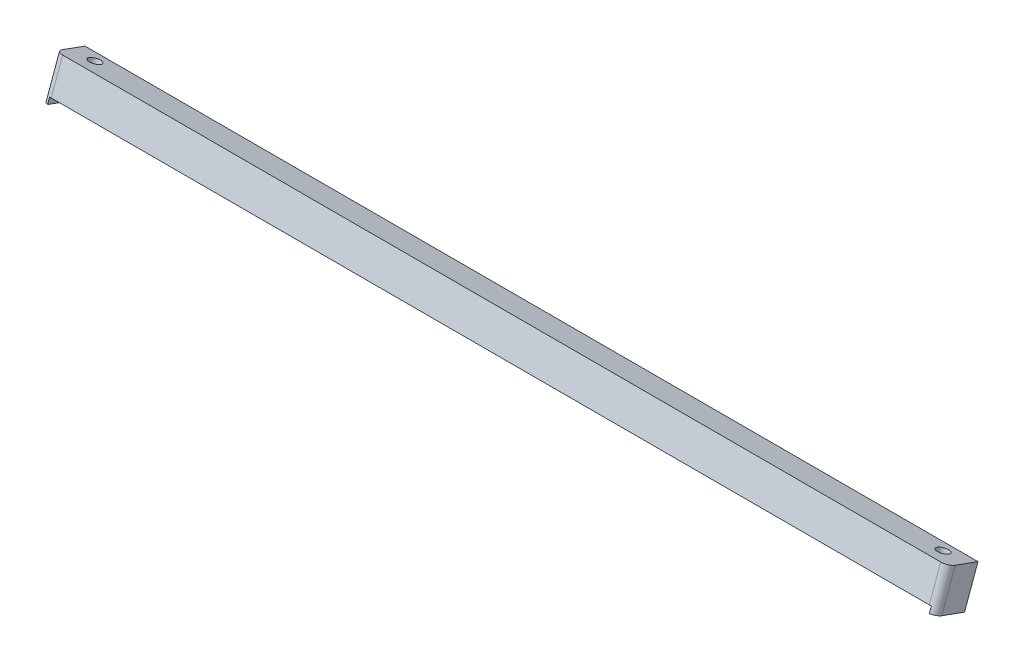
ISO-10303-21;
HEADER;
FILE_DESCRIPTION(('STEP AP214'),'2;1');
FILE_NAME('part.step','',(''),(''),'','','');
FILE_SCHEMA(('AUTOMOTIVE_DESIGN { 1 0 10303 214 1 1 1 1 }'));
ENDSEC;
DATA;
#1=APPLICATION_CONTEXT('core data for automotive mechanical design processes');
#2=APPLICATION_PROTOCOL_DEFINITION('international standard','automotive_design',2000,#1);
#3=PRODUCT_CONTEXT('',#1,'mechanical');
#4=PRODUCT('Part','Part','',(#3));
#5=PRODUCT_RELATED_PRODUCT_CATEGORY('part','',(#4));
#6=PRODUCT_DEFINITION_FORMATION('','',#4);
#7=PRODUCT_DEFINITION_CONTEXT('part definition',#1,'design');
#8=PRODUCT_DEFINITION('design','',#6,#7);
#9=PRODUCT_DEFINITION_SHAPE('','',#8);
#10=(LENGTH_UNIT() NAMED_UNIT(*) SI_UNIT(.MILLI.,.METRE.));
#11=(NAMED_UNIT(*) PLANE_ANGLE_UNIT() SI_UNIT($,.RADIAN.));
#12=(NAMED_UNIT(*) SI_UNIT($,.STERADIAN.) SOLID_ANGLE_UNIT());
#13=UNCERTAINTY_MEASURE_WITH_UNIT(LENGTH_MEASURE(1.E-05),#10,'distance_accuracy_value','');
#14=(GEOMETRIC_REPRESENTATION_CONTEXT(3) GLOBAL_UNCERTAINTY_ASSIGNED_CONTEXT((#13)) GLOBAL_UNIT_ASSIGNED_CONTEXT((#10,
#11,#12)) REPRESENTATION_CONTEXT('',''));
#15=CARTESIAN_POINT('',(0.,0.,0.));
#16=DIRECTION('',(0.,0.,1.));
#17=DIRECTION('',(1.,0.,0.));
#18=AXIS2_PLACEMENT_3D('',#15,#16,#17);
#19=CARTESIAN_POINT('',(239.,3.93699985869353,8.11895783615206));
#20=DIRECTION('',(0.,-0.342020143325677,-0.939692620785905));
#21=DIRECTION('',(0.,0.939692620785905,-0.342020143325677));
#22=AXIS2_PLACEMENT_3D('',#19,#20,#21);
#23=PLANE('',#22);
#24=DIRECTION('',(1.,0.,0.));
#25=VECTOR('',#24,1.);
#26=CARTESIAN_POINT('',(239.,12.3472488147274,5.05787755338725));
#27=LINE('',#26,#25);
#28=CARTESIAN_POINT('',(2.,12.3472488147274,5.05787755338725));
#29=VERTEX_POINT('',#28);
#30=CARTESIAN_POINT('',(237.,12.3472488147274,5.05787755338725));
#31=VERTEX_POINT('',#30);
#32=EDGE_CURVE('E110',#29,#31,#27,.T.);
#33=ORIENTED_EDGE('',*,*,#32,.F.);
#34=DIRECTION('',(0.,-0.939692620785905,0.342020143325677));
#35=VECTOR('',#34,1.);
#36=CARTESIAN_POINT('',(2.,3.93699985869353,8.11895783615206));
#37=LINE('',#36,#35);
#38=CARTESIAN_POINT('',(2.00000000000006,3.93699985869353,8.11895783615206));
#39=VERTEX_POINT('',#38);
#40=EDGE_CURVE('E119',#29,#39,#37,.T.);
#41=ORIENTED_EDGE('',*,*,#40,.T.);
#42=DIRECTION('',(-1.,0.,0.));
#43=VECTOR('',#42,1.);
#44=CARTESIAN_POINT('',(239.,3.93699985869353,8.11895783615206));
#45=LINE('',#44,#43);
#46=CARTESIAN_POINT('',(237.,3.93699985869353,8.11895783615206));
#47=VERTEX_POINT('',#46);
#48=EDGE_CURVE('E171',#47,#39,#45,.T.);
#49=ORIENTED_EDGE('',*,*,#48,.F.);
#50=DIRECTION('',(0.,-0.939692620785905,0.342020143325677));
#51=VECTOR('',#50,1.);
#52=CARTESIAN_POINT('',(237.,12.8640797561596,4.86976647455813));
#53=LINE('',#52,#51);
#54=EDGE_CURVE('E122',#47,#31,#53,.F.);
#55=ORIENTED_EDGE('',*,*,#54,.T.);
#56=EDGE_LOOP('',(#33,#41,#49,#55));
#57=FACE_BOUND('',#56,.T.);
#58=ADVANCED_FACE('F32',(#57),#23,.F.);
#59=CARTESIAN_POINT('',(239.,8.37851176280194,-2.54313135812773));
#60=DIRECTION('',(0.,0.342020143325677,0.939692620785905));
#61=DIRECTION('',(0.,-0.939692620785905,0.342020143325677));
#62=AXIS2_PLACEMENT_3D('',#59,#60,#61);
#63=PLANE('',#62);
#64=DIRECTION('',(-1.,0.,0.));
#65=VECTOR('',#64,1.);
#66=CARTESIAN_POINT('',(239.,9.44007759645913,-2.92950972329294));
#67=LINE('',#66,#65);
#68=CARTESIAN_POINT('',(239.,9.44007759645913,-2.92950972329294));
#69=VERTEX_POINT('',#68);
#70=CARTESIAN_POINT('',(0.,9.44007759645913,-2.92950972329294));
#71=VERTEX_POINT('',#70);
#72=EDGE_CURVE('E124',#69,#71,#67,.T.);
#73=ORIENTED_EDGE('',*,*,#72,.F.);
#74=DIRECTION('',(0.,0.939692620785905,-0.342020143325677));
#75=VECTOR('',#74,1.);
#76=CARTESIAN_POINT('',(239.,8.37851176280194,-2.54313135812773));
#77=LINE('',#76,#75);
#78=CARTESIAN_POINT('',(239.,-0.473679552832177,0.678802788792954));
#79=VERTEX_POINT('',#78);
#80=EDGE_CURVE('E162',#79,#69,#77,.T.);
#81=ORIENTED_EDGE('',*,*,#80,.F.);
#82=DIRECTION('',(-1.,0.,0.));
#83=VECTOR('',#82,1.);
#84=CARTESIAN_POINT('',(239.,-0.473679552832177,0.678802788792954));
#85=LINE('',#84,#83);
#86=CARTESIAN_POINT('',(237.5,-0.473679552832177,0.678802788792954));
#87=VERTEX_POINT('',#86);
#88=EDGE_CURVE('E208',#79,#87,#85,.T.);
#89=ORIENTED_EDGE('',*,*,#88,.T.);
#90=DIRECTION('',(0.,0.939692620785905,-0.342020143325677));
#91=VECTOR('',#90,1.);
#92=CARTESIAN_POINT('',(237.5,-0.473679552832177,0.678802788792954));
#93=LINE('',#92,#91);
#94=CARTESIAN_POINT('',(237.5,1.02982864042527,0.13157055947187));
#95=VERTEX_POINT('',#94);
#96=EDGE_CURVE('E159',#87,#95,#93,.T.);
#97=ORIENTED_EDGE('',*,*,#96,.T.);
#98=DIRECTION('',(-1.,0.,0.));
#99=VECTOR('',#98,1.);
#100=CARTESIAN_POINT('',(239.,1.02982864042527,0.13157055947187));
#101=LINE('',#100,#99);
#102=CARTESIAN_POINT('',(1.50000000000006,1.02982864042527,0.13157055947187));
#103=VERTEX_POINT('',#102);
#104=EDGE_CURVE('E165',#95,#103,#101,.T.);
#105=ORIENTED_EDGE('',*,*,#104,.T.);
#106=DIRECTION('',(0.,0.939692620785905,-0.342020143325677));
#107=VECTOR('',#106,1.);
#108=CARTESIAN_POINT('',(1.5,-0.473679552832177,0.678802788792954));
#109=LINE('',#108,#107);
#110=CARTESIAN_POINT('',(1.5,-0.473679552832177,0.678802788792954));
#111=VERTEX_POINT('',#110);
#112=EDGE_CURVE('E153',#111,#103,#109,.T.);
#113=ORIENTED_EDGE('',*,*,#112,.F.);
#114=DIRECTION('',(-1.,0.,0.));
#115=VECTOR('',#114,1.);
#116=CARTESIAN_POINT('',(0.,-0.473679552832177,0.678802788792954));
#117=LINE('',#116,#115);
#118=CARTESIAN_POINT('',(0.,-0.473679552832177,0.678802788792954));
#119=VERTEX_POINT('',#118);
#120=EDGE_CURVE('E151',#111,#119,#117,.T.);
#121=ORIENTED_EDGE('',*,*,#120,.T.);
#122=DIRECTION('',(0.,0.939692620785905,-0.342020143325677));
#123=VECTOR('',#122,1.);
#124=CARTESIAN_POINT('',(0.,8.37851176280194,-2.54313135812773));
#125=LINE('',#124,#123);
#126=EDGE_CURVE('E166',#119,#71,#125,.T.);
#127=ORIENTED_EDGE('',*,*,#126,.T.);
#128=EDGE_LOOP('',(#73,#81,#89,#97,#105,#113,#121,#127));
#129=FACE_BOUND('',#128,.T.);
#130=ADVANCED_FACE('F217',(#129),#63,.F.);
#131=CARTESIAN_POINT('',(239.,0.,0.));
#132=DIRECTION('',(1.,0.,0.));
#133=DIRECTION('',(0.,0.,-1.));
#134=AXIS2_PLACEMENT_3D('',#131,#132,#133);
#135=PLANE('',#134);
#136=ORIENTED_EDGE('',*,*,#80,.T.);
#137=DIRECTION('',(0.,0.342020143325677,0.939692620785905));
#138=VECTOR('',#137,1.);
#139=CARTESIAN_POINT('',(239.,9.27732456721374,-3.37666999609248));
#140=LINE('',#139,#138);
#141=CARTESIAN_POINT('',(239.,11.663208528076,3.17849231181544));
#142=VERTEX_POINT('',#141);
#143=EDGE_CURVE('E194',#69,#142,#140,.T.);
#144=ORIENTED_EDGE('',*,*,#143,.T.);
#145=DIRECTION('',(0.,-0.939692620785905,0.342020143325677));
#146=VECTOR('',#145,1.);
#147=CARTESIAN_POINT('',(239.,1.74945137878473,6.78680482390134));
#148=LINE('',#147,#146);
#149=CARTESIAN_POINT('',(239.,1.74945137878473,6.78680482390134));
#150=VERTEX_POINT('',#149);
#151=EDGE_CURVE('E173',#142,#150,#148,.T.);
#152=ORIENTED_EDGE('',*,*,#151,.T.);
#153=DIRECTION('',(0.,-0.342020143325677,-0.939692620785905));
#154=VECTOR('',#153,1.);
#155=CARTESIAN_POINT('',(239.,-0.473679552832177,0.678802788792954));
#156=LINE('',#155,#154);
#157=EDGE_CURVE('E206',#150,#79,#156,.T.);
#158=ORIENTED_EDGE('',*,*,#157,.T.);
#159=EDGE_LOOP('',(#136,#144,#152,#158));
#160=FACE_BOUND('',#159,.T.);
#161=ADVANCED_FACE('F227',(#160),#135,.T.);
#162=CARTESIAN_POINT('',(0.,0.,0.));
#163=DIRECTION('',(1.,0.,0.));
#164=DIRECTION('',(0.,0.,-1.));
#165=AXIS2_PLACEMENT_3D('',#162,#163,#164);
#166=PLANE('',#165);
#167=DIRECTION('',(0.,0.342020143325677,0.939692620785905));
#168=VECTOR('',#167,1.);
#169=CARTESIAN_POINT('',(0.,9.27732456721374,-3.37666999609248));
#170=LINE('',#169,#168);
#171=CARTESIAN_POINT('',(0.,11.663208528076,3.17849231181544));
#172=VERTEX_POINT('',#171);
#173=EDGE_CURVE('E47',#71,#172,#170,.T.);
#174=ORIENTED_EDGE('',*,*,#173,.F.);
#175=ORIENTED_EDGE('',*,*,#126,.F.);
#176=DIRECTION('',(0.,0.342020143325677,0.939692620785905));
#177=VECTOR('',#176,1.);
#178=CARTESIAN_POINT('',(0.,-0.473679552832177,0.678802788792954));
#179=LINE('',#178,#177);
#180=CARTESIAN_POINT('',(0.,1.74945137878473,6.78680482390134));
#181=VERTEX_POINT('',#180);
#182=EDGE_CURVE('E140',#119,#181,#179,.T.);
#183=ORIENTED_EDGE('',*,*,#182,.T.);
#184=DIRECTION('',(0.,-0.939692620785905,0.342020143325677));
#185=VECTOR('',#184,1.);
#186=CARTESIAN_POINT('',(0.,2.38588396086229,6.55516230790792));
#187=LINE('',#186,#185);
#188=EDGE_CURVE('E40',#181,#172,#187,.F.);
#189=ORIENTED_EDGE('',*,*,#188,.T.);
#190=EDGE_LOOP('',(#174,#175,#183,#189));
#191=FACE_BOUND('',#190,.T.);
#192=ADVANCED_FACE('F138',(#191),#166,.F.);
#193=CARTESIAN_POINT('',(233.,-0.31564631529921,4.42229577685741));
#194=DIRECTION('',(0.,0.939692620785905,-0.342020143325677));
#195=DIRECTION('',(0.,0.342020143325677,0.939692620785905));
#196=AXIS2_PLACEMENT_3D('',#193,#194,#195);
#197=CYLINDRICAL_SURFACE('',#196,1.59999999999999);
#198=CARTESIAN_POINT('',(233.,2.2514504723098,3.48794895768732));
#199=DIRECTION('',(0.,0.939692620785905,-0.342020143325677));
#200=DIRECTION('',(0.,0.342020143325677,0.939692620785905));
#201=AXIS2_PLACEMENT_3D('',#198,#199,#200);
#202=CIRCLE('',#201,1.59999999999999);
#203=CARTESIAN_POINT('',(233.,2.79868270163088,4.99145715094476));
#204=VERTEX_POINT('',#203);
#205=EDGE_CURVE('E161',#204,#204,#202,.T.);
#206=ORIENTED_EDGE('',*,*,#205,.F.);
#207=EDGE_LOOP('',(#206));
#208=FACE_BOUND('',#207,.T.);
#209=CARTESIAN_POINT('',(233.,10.6616994283437,0.426868674922504));
#210=DIRECTION('',(0.,0.939692620785905,-0.342020143325677));
#211=DIRECTION('',(0.,0.342020143325677,0.939692620785905));
#212=AXIS2_PLACEMENT_3D('',#209,#210,#211);
#213=CIRCLE('',#212,1.59999999999999);
#214=CARTESIAN_POINT('',(233.,11.2089316576647,1.93037686817994));
#215=VERTEX_POINT('',#214);
#216=EDGE_CURVE('E202',#215,#215,#213,.F.);
#217=ORIENTED_EDGE('',*,*,#216,.F.);
#218=EDGE_LOOP('',(#217));
#219=FACE_BOUND('',#218,.T.);
#220=ADVANCED_FACE('F235',(#208,#219),#197,.F.);
#221=CARTESIAN_POINT('',(5.99999999999999,-0.315646315299217,4.42229577685745));
#222=DIRECTION('',(0.,0.939692620785905,-0.342020143325677));
#223=DIRECTION('',(0.,0.342020143325677,0.939692620785905));
#224=AXIS2_PLACEMENT_3D('',#221,#222,#223);
#225=CYLINDRICAL_SURFACE('',#224,1.6);
#226=CARTESIAN_POINT('',(5.99999999999999,2.25145047230981,3.48794895768734));
#227=DIRECTION('',(0.,0.939692620785905,-0.342020143325677));
#228=DIRECTION('',(0.,0.342020143325677,0.939692620785905));
#229=AXIS2_PLACEMENT_3D('',#226,#227,#228);
#230=CIRCLE('',#229,1.6);
#231=CARTESIAN_POINT('',(5.99999999999999,2.7986827016309,4.99145715094479));
#232=VERTEX_POINT('',#231);
#233=EDGE_CURVE('E168',#232,#232,#230,.F.);
#234=ORIENTED_EDGE('',*,*,#233,.T.);
#235=EDGE_LOOP('',(#234));
#236=FACE_BOUND('',#235,.T.);
#237=CARTESIAN_POINT('',(5.99999999999999,10.6616994283437,0.426868674922531));
#238=DIRECTION('',(0.,0.939692620785905,-0.342020143325677));
#239=DIRECTION('',(0.,0.342020143325677,0.939692620785905));
#240=AXIS2_PLACEMENT_3D('',#237,#238,#239);
#241=CIRCLE('',#240,1.6);
#242=CARTESIAN_POINT('',(5.99999999999999,11.2089316576648,1.93037686817998));
#243=VERTEX_POINT('',#242);
#244=EDGE_CURVE('E196',#243,#243,#241,.T.);
#245=ORIENTED_EDGE('',*,*,#244,.T.);
#246=EDGE_LOOP('',(#245));
#247=FACE_BOUND('',#246,.T.);
#248=ADVANCED_FACE('F245',(#236,#247),#225,.F.);
#249=CARTESIAN_POINT('',(237.,2.38588396086229,6.55516230790792));
#250=DIRECTION('',(0.,0.939692620785905,-0.342020143325677));
#251=DIRECTION('',(0.,0.342020143325677,0.939692620785905));
#252=AXIS2_PLACEMENT_3D('',#249,#250,#251);
#253=CYLINDRICAL_SURFACE('',#252,2.);
#254=ORIENTED_EDGE('',*,*,#151,.F.);
#255=CARTESIAN_POINT('',(237.,11.663208528076,3.17849231181544));
#256=DIRECTION('',(0.,0.939692620785905,-0.342020143325677));
#257=DIRECTION('',(0.,0.342020143325677,0.939692620785905));
#258=AXIS2_PLACEMENT_3D('',#255,#256,#257);
#259=CIRCLE('',#258,2.);
#260=EDGE_CURVE('E123',#142,#31,#259,.F.);
#261=ORIENTED_EDGE('',*,*,#260,.T.);
#262=ORIENTED_EDGE('',*,*,#54,.F.);
#263=CARTESIAN_POINT('',(237.,3.25295957204217,6.23957259458026));
#264=DIRECTION('',(0.,0.939692620785905,-0.342020143325677));
#265=DIRECTION('',(0.,0.342020143325677,0.939692620785905));
#266=AXIS2_PLACEMENT_3D('',#263,#264,#265);
#267=CIRCLE('',#266,2.);
#268=CARTESIAN_POINT('',(237.5,3.91527873162608,8.05927953000916));
#269=VERTEX_POINT('',#268);
#270=EDGE_CURVE('E129',#269,#47,#267,.F.);
#271=ORIENTED_EDGE('',*,*,#270,.F.);
#272=DIRECTION('',(0.,0.939692620785905,-0.342020143325677));
#273=VECTOR('',#272,1.);
#274=CARTESIAN_POINT('',(237.5,2.41177053836864,8.60651175933025));
#275=LINE('',#274,#273);
#276=CARTESIAN_POINT('',(237.5,2.41177053836864,8.60651175933025));
#277=VERTEX_POINT('',#276);
#278=EDGE_CURVE('E181',#277,#269,#275,.T.);
#279=ORIENTED_EDGE('',*,*,#278,.F.);
#280=CARTESIAN_POINT('',(237.,1.74945137878473,6.78680482390134));
#281=DIRECTION('',(0.,-0.939692620785905,0.342020143325677));
#282=DIRECTION('',(0.,-0.342020143325677,-0.939692620785905));
#283=AXIS2_PLACEMENT_3D('',#280,#281,#282);
#284=CIRCLE('',#283,2.);
#285=EDGE_CURVE('E179',#150,#277,#284,.T.);
#286=ORIENTED_EDGE('',*,*,#285,.F.);
#287=EDGE_LOOP('',(#254,#261,#262,#271,#279,#286));
#288=FACE_BOUND('',#287,.T.);
#289=ADVANCED_FACE('F190',(#288),#253,.T.);
#290=CARTESIAN_POINT('',(2.,3.25295957204217,6.23957259458026));
#291=DIRECTION('',(0.,-0.939692620785905,0.342020143325677));
#292=DIRECTION('',(0.,-0.342020143325677,-0.939692620785905));
#293=AXIS2_PLACEMENT_3D('',#290,#291,#292);
#294=CYLINDRICAL_SURFACE('',#293,2.);
#295=ORIENTED_EDGE('',*,*,#40,.F.);
#296=CARTESIAN_POINT('',(2.,11.663208528076,3.17849231181544));
#297=DIRECTION('',(0.,0.939692620785905,-0.342020143325677));
#298=DIRECTION('',(0.,0.342020143325677,0.939692620785905));
#299=AXIS2_PLACEMENT_3D('',#296,#297,#298);
#300=CIRCLE('',#299,2.);
#301=EDGE_CURVE('E11',#29,#172,#300,.F.);
#302=ORIENTED_EDGE('',*,*,#301,.T.);
#303=ORIENTED_EDGE('',*,*,#188,.F.);
#304=CARTESIAN_POINT('',(2.,1.74945137878473,6.78680482390134));
#305=DIRECTION('',(0.,0.939692620785905,-0.342020143325677));
#306=DIRECTION('',(0.,0.342020143325677,0.939692620785905));
#307=AXIS2_PLACEMENT_3D('',#304,#305,#306);
#308=CIRCLE('',#307,2.);
#309=CARTESIAN_POINT('',(1.5,2.41177053836864,8.60651175933025));
#310=VERTEX_POINT('',#309);
#311=EDGE_CURVE('E54',#310,#181,#308,.F.);
#312=ORIENTED_EDGE('',*,*,#311,.F.);
#313=DIRECTION('',(0.,-0.939692620785905,0.342020143325677));
#314=VECTOR('',#313,1.);
#315=CARTESIAN_POINT('',(1.5,3.91527873162608,8.05927953000916));
#316=LINE('',#315,#314);
#317=CARTESIAN_POINT('',(1.5,3.91527873162608,8.05927953000916));
#318=VERTEX_POINT('',#317);
#319=EDGE_CURVE('E131',#318,#310,#316,.T.);
#320=ORIENTED_EDGE('',*,*,#319,.F.);
#321=CARTESIAN_POINT('',(2.,3.25295957204217,6.23957259458026));
#322=DIRECTION('',(0.,0.939692620785905,-0.342020143325677));
#323=DIRECTION('',(0.,0.342020143325677,0.939692620785905));
#324=AXIS2_PLACEMENT_3D('',#321,#322,#323);
#325=CIRCLE('',#324,2.);
#326=EDGE_CURVE('E127',#39,#318,#325,.F.);
#327=ORIENTED_EDGE('',*,*,#326,.F.);
#328=EDGE_LOOP('',(#295,#302,#303,#312,#320,#327));
#329=FACE_BOUND('',#328,.T.);
#330=ADVANCED_FACE('F34',(#329),#294,.T.);
#331=CARTESIAN_POINT('',(239.,1.02982864042527,0.13157055947187));
#332=DIRECTION('',(0.,0.939692620785905,-0.342020143325677));
#333=DIRECTION('',(0.,0.342020143325677,0.939692620785905));
#334=AXIS2_PLACEMENT_3D('',#331,#332,#333);
#335=PLANE('',#334);
#336=ORIENTED_EDGE('',*,*,#205,.T.);
#337=EDGE_LOOP('',(#336));
#338=FACE_BOUND('',#337,.T.);
#339=DIRECTION('',(0.,0.342020143325677,0.939692620785905));
#340=VECTOR('',#339,1.);
#341=CARTESIAN_POINT('',(237.5,1.02982864042527,0.13157055947187));
#342=LINE('',#341,#340);
#343=EDGE_CURVE('E205',#95,#269,#342,.T.);
#344=ORIENTED_EDGE('',*,*,#343,.T.);
#345=ORIENTED_EDGE('',*,*,#270,.T.);
#346=ORIENTED_EDGE('',*,*,#48,.T.);
#347=ORIENTED_EDGE('',*,*,#326,.T.);
#348=DIRECTION('',(0.,-0.342020143325677,-0.939692620785905));
#349=VECTOR('',#348,1.);
#350=CARTESIAN_POINT('',(1.5,1.02982864042527,0.13157055947187));
#351=LINE('',#350,#349);
#352=EDGE_CURVE('E147',#318,#103,#351,.T.);
#353=ORIENTED_EDGE('',*,*,#352,.T.);
#354=ORIENTED_EDGE('',*,*,#104,.F.);
#355=EDGE_LOOP('',(#344,#345,#346,#347,#353,#354));
#356=FACE_BOUND('',#355,.T.);
#357=ORIENTED_EDGE('',*,*,#233,.F.);
#358=EDGE_LOOP('',(#357));
#359=FACE_BOUND('',#358,.T.);
#360=ADVANCED_FACE('F184',(#338,#356,#359),#335,.F.);
#361=CARTESIAN_POINT('',(1.5,-0.473679552832177,0.678802788792954));
#362=DIRECTION('',(1.,0.,0.));
#363=DIRECTION('',(0.,0.,-1.));
#364=AXIS2_PLACEMENT_3D('',#361,#362,#363);
#365=PLANE('',#364);
#366=ORIENTED_EDGE('',*,*,#352,.F.);
#367=ORIENTED_EDGE('',*,*,#319,.T.);
#368=DIRECTION('',(0.,-0.342020143325677,-0.939692620785905));
#369=VECTOR('',#368,1.);
#370=CARTESIAN_POINT('',(1.5,-0.473679552832177,0.678802788792954));
#371=LINE('',#370,#369);
#372=EDGE_CURVE('E145',#310,#111,#371,.T.);
#373=ORIENTED_EDGE('',*,*,#372,.T.);
#374=ORIENTED_EDGE('',*,*,#112,.T.);
#375=EDGE_LOOP('',(#366,#367,#373,#374));
#376=FACE_BOUND('',#375,.T.);
#377=ADVANCED_FACE('F143',(#376),#365,.T.);
#378=CARTESIAN_POINT('',(0.,-0.636432582077565,0.231642515993422));
#379=DIRECTION('',(0.,0.939692620785905,-0.342020143325677));
#380=DIRECTION('',(0.,0.342020143325677,0.939692620785905));
#381=AXIS2_PLACEMENT_3D('',#378,#379,#380);
#382=PLANE('',#381);
#383=ORIENTED_EDGE('',*,*,#372,.F.);
#384=ORIENTED_EDGE('',*,*,#311,.T.);
#385=ORIENTED_EDGE('',*,*,#182,.F.);
#386=ORIENTED_EDGE('',*,*,#120,.F.);
#387=EDGE_LOOP('',(#383,#384,#385,#386));
#388=FACE_BOUND('',#387,.T.);
#389=ADVANCED_FACE('F149',(#388),#382,.F.);
#390=CARTESIAN_POINT('',(237.5,-0.473679552832177,0.678802788792954));
#391=DIRECTION('',(-1.,0.,0.));
#392=DIRECTION('',(0.,0.,1.));
#393=AXIS2_PLACEMENT_3D('',#390,#391,#392);
#394=PLANE('',#393);
#395=DIRECTION('',(0.,0.342020143325677,0.939692620785905));
#396=VECTOR('',#395,1.);
#397=CARTESIAN_POINT('',(237.5,-0.473679552832177,0.678802788792954));
#398=LINE('',#397,#396);
#399=EDGE_CURVE('E211',#87,#277,#398,.T.);
#400=ORIENTED_EDGE('',*,*,#399,.T.);
#401=ORIENTED_EDGE('',*,*,#278,.T.);
#402=ORIENTED_EDGE('',*,*,#343,.F.);
#403=ORIENTED_EDGE('',*,*,#96,.F.);
#404=EDGE_LOOP('',(#400,#401,#402,#403));
#405=FACE_BOUND('',#404,.T.);
#406=ADVANCED_FACE('F222',(#405),#394,.T.);
#407=CARTESIAN_POINT('',(0.,-0.636432582077632,0.231642515993446));
#408=DIRECTION('',(0.,-0.939692620785905,0.342020143325677));
#409=DIRECTION('',(0.,-0.342020143325677,-0.939692620785905));
#410=AXIS2_PLACEMENT_3D('',#407,#408,#409);
#411=PLANE('',#410);
#412=ORIENTED_EDGE('',*,*,#157,.F.);
#413=ORIENTED_EDGE('',*,*,#285,.T.);
#414=ORIENTED_EDGE('',*,*,#399,.F.);
#415=ORIENTED_EDGE('',*,*,#88,.F.);
#416=EDGE_LOOP('',(#412,#413,#414,#415));
#417=FACE_BOUND('',#416,.T.);
#418=ADVANCED_FACE('F225',(#417),#411,.T.);
#419=CARTESIAN_POINT('',(0.,9.27732456721374,-3.37666999609248));
#420=DIRECTION('',(0.,0.939692620785905,-0.342020143325677));
#421=DIRECTION('',(0.,0.342020143325677,0.939692620785905));
#422=AXIS2_PLACEMENT_3D('',#419,#420,#421);
#423=PLANE('',#422);
#424=ORIENTED_EDGE('',*,*,#244,.F.);
#425=EDGE_LOOP('',(#424));
#426=FACE_BOUND('',#425,.T.);
#427=ORIENTED_EDGE('',*,*,#72,.T.);
#428=ORIENTED_EDGE('',*,*,#173,.T.);
#429=ORIENTED_EDGE('',*,*,#301,.F.);
#430=ORIENTED_EDGE('',*,*,#32,.T.);
#431=ORIENTED_EDGE('',*,*,#260,.F.);
#432=ORIENTED_EDGE('',*,*,#143,.F.);
#433=EDGE_LOOP('',(#427,#428,#429,#430,#431,#432));
#434=FACE_BOUND('',#433,.T.);
#435=ORIENTED_EDGE('',*,*,#216,.T.);
#436=EDGE_LOOP('',(#435));
#437=FACE_BOUND('',#436,.T.);
#438=ADVANCED_FACE('F108',(#426,#434,#437),#423,.T.);
#439=CLOSED_SHELL('',(#58,#130,#161,#192,#220,#248,#289,#330,#360,#377,#389,#406,#418,#438));
#440=MANIFOLD_SOLID_BREP('B2',#439);
#441=ADVANCED_BREP_SHAPE_REPRESENTATION('',(#18,#440),#14);
#442=SHAPE_DEFINITION_REPRESENTATION(#9,#441);
ENDSEC;
END-ISO-10303-21;
